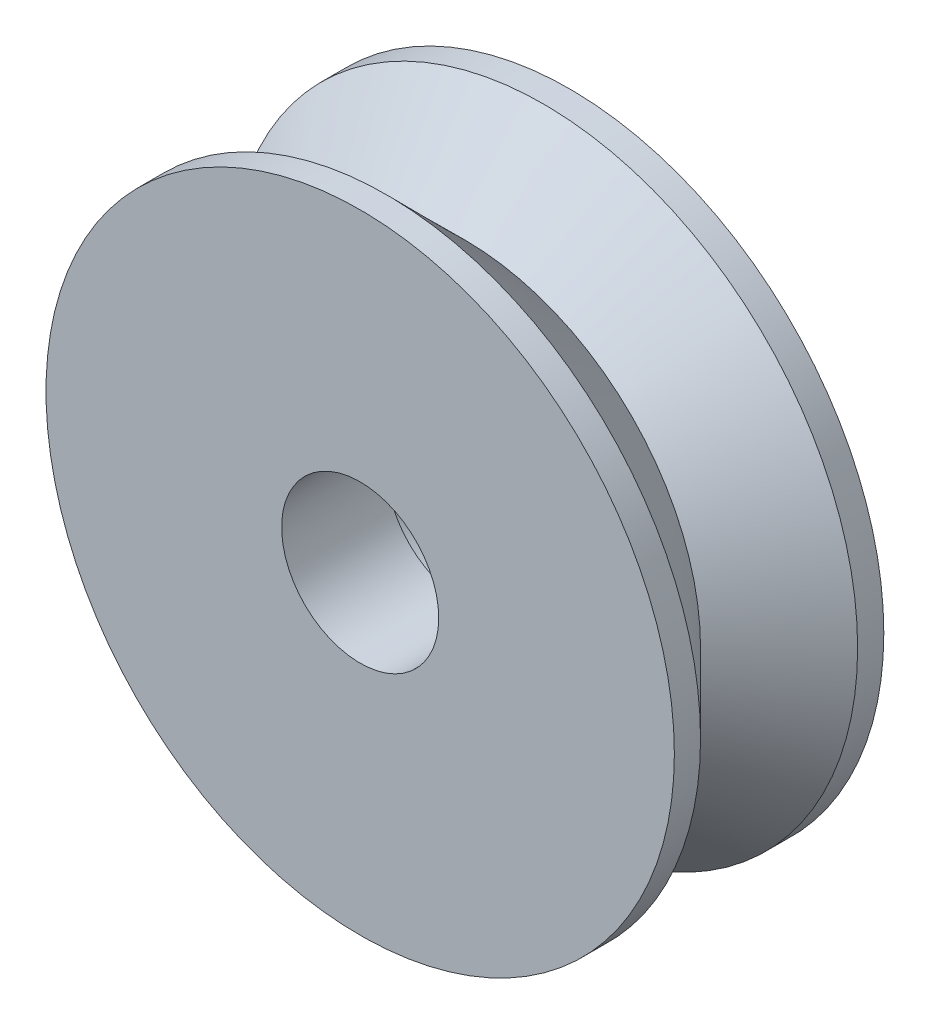
ISO-10303-21;
HEADER;
FILE_DESCRIPTION(('STEP AP214'),'2;1');
FILE_NAME('part.step','',(''),(''),'','','');
FILE_SCHEMA(('AUTOMOTIVE_DESIGN { 1 0 10303 214 1 1 1 1 }'));
ENDSEC;
DATA;
#1=APPLICATION_CONTEXT('core data for automotive mechanical design processes');
#2=APPLICATION_PROTOCOL_DEFINITION('international standard','automotive_design',2000,#1);
#3=PRODUCT_CONTEXT('',#1,'mechanical');
#4=PRODUCT('Part','Part','',(#3));
#5=PRODUCT_RELATED_PRODUCT_CATEGORY('part','',(#4));
#6=PRODUCT_DEFINITION_FORMATION('','',#4);
#7=PRODUCT_DEFINITION_CONTEXT('part definition',#1,'design');
#8=PRODUCT_DEFINITION('design','',#6,#7);
#9=PRODUCT_DEFINITION_SHAPE('','',#8);
#10=(LENGTH_UNIT() NAMED_UNIT(*) SI_UNIT(.MILLI.,.METRE.));
#11=(NAMED_UNIT(*) PLANE_ANGLE_UNIT() SI_UNIT($,.RADIAN.));
#12=(NAMED_UNIT(*) SI_UNIT($,.STERADIAN.) SOLID_ANGLE_UNIT());
#13=UNCERTAINTY_MEASURE_WITH_UNIT(LENGTH_MEASURE(1.E-05),#10,'distance_accuracy_value','');
#14=(GEOMETRIC_REPRESENTATION_CONTEXT(3) GLOBAL_UNCERTAINTY_ASSIGNED_CONTEXT((#13)) GLOBAL_UNIT_ASSIGNED_CONTEXT((#10,
#11,#12)) REPRESENTATION_CONTEXT('',''));
#15=CARTESIAN_POINT('',(0.,0.,0.));
#16=DIRECTION('',(0.,0.,1.));
#17=DIRECTION('',(1.,0.,0.));
#18=AXIS2_PLACEMENT_3D('',#15,#16,#17);
#19=CARTESIAN_POINT('',(0.,0.,0.));
#20=DIRECTION('',(0.,0.,1.));
#21=DIRECTION('',(1.,0.,0.));
#22=AXIS2_PLACEMENT_3D('',#19,#20,#21);
#23=PLANE('',#22);
#24=CARTESIAN_POINT('',(0.,0.,0.));
#25=DIRECTION('',(0.,0.,1.));
#26=DIRECTION('',(1.,0.,0.));
#27=AXIS2_PLACEMENT_3D('',#24,#25,#26);
#28=CIRCLE('',#27,5.99999999999908);
#29=CARTESIAN_POINT('',(5.99999999999908,0.,0.));
#30=VERTEX_POINT('',#29);
#31=EDGE_CURVE('E46',#30,#30,#28,.T.);
#32=ORIENTED_EDGE('',*,*,#31,.F.);
#33=EDGE_LOOP('',(#32));
#34=FACE_BOUND('',#33,.T.);
#35=CARTESIAN_POINT('',(0.,0.,0.));
#36=DIRECTION('',(0.,0.,1.));
#37=DIRECTION('',(1.,0.,0.));
#38=AXIS2_PLACEMENT_3D('',#35,#36,#37);
#39=CIRCLE('',#38,1.7);
#40=CARTESIAN_POINT('',(1.7,0.,0.));
#41=VERTEX_POINT('',#40);
#42=EDGE_CURVE('E51',#41,#41,#39,.T.);
#43=ORIENTED_EDGE('',*,*,#42,.T.);
#44=EDGE_LOOP('',(#43));
#45=FACE_BOUND('',#44,.T.);
#46=ADVANCED_FACE('F31',(#34,#45),#23,.F.);
#47=CARTESIAN_POINT('',(0.,0.,2.));
#48=DIRECTION('',(0.,0.,-1.));
#49=DIRECTION('',(-1.,0.,0.));
#50=AXIS2_PLACEMENT_3D('',#47,#48,#49);
#51=CYLINDRICAL_SURFACE('',#50,5.99999999999908);
#52=CARTESIAN_POINT('',(0.,0.,0.499999999999999));
#53=DIRECTION('',(0.,0.,1.));
#54=DIRECTION('',(1.,0.,0.));
#55=AXIS2_PLACEMENT_3D('',#52,#53,#54);
#56=CIRCLE('',#55,5.99999999999908);
#57=CARTESIAN_POINT('',(5.99999999999908,0.,0.499999999999999));
#58=VERTEX_POINT('',#57);
#59=EDGE_CURVE('E38',#58,#58,#56,.F.);
#60=ORIENTED_EDGE('',*,*,#59,.T.);
#61=EDGE_LOOP('',(#60));
#62=FACE_BOUND('',#61,.T.);
#63=ORIENTED_EDGE('',*,*,#31,.T.);
#64=EDGE_LOOP('',(#63));
#65=FACE_BOUND('',#64,.T.);
#66=ADVANCED_FACE('F86',(#62,#65),#51,.T.);
#67=CARTESIAN_POINT('',(0.,0.,2.));
#68=DIRECTION('',(0.,0.,-1.));
#69=DIRECTION('',(-1.,0.,0.));
#70=AXIS2_PLACEMENT_3D('',#67,#68,#69);
#71=CYLINDRICAL_SURFACE('',#70,1.7);
#72=CARTESIAN_POINT('',(0.,0.,2.));
#73=DIRECTION('',(0.,0.,1.));
#74=DIRECTION('',(1.,0.,0.));
#75=AXIS2_PLACEMENT_3D('',#72,#73,#74);
#76=CIRCLE('',#75,1.7);
#77=CARTESIAN_POINT('',(1.7,0.,2.));
#78=VERTEX_POINT('',#77);
#79=EDGE_CURVE('E54',#78,#78,#76,.T.);
#80=ORIENTED_EDGE('',*,*,#79,.T.);
#81=EDGE_LOOP('',(#80));
#82=FACE_BOUND('',#81,.T.);
#83=ORIENTED_EDGE('',*,*,#42,.F.);
#84=EDGE_LOOP('',(#83));
#85=FACE_BOUND('',#84,.T.);
#86=ADVANCED_FACE('F92',(#82,#85),#71,.F.);
#87=CARTESIAN_POINT('',(0.,0.,2.));
#88=DIRECTION('',(0.,0.,-1.));
#89=DIRECTION('',(-1.,0.,0.));
#90=AXIS2_PLACEMENT_3D('',#87,#88,#89);
#91=CONICAL_SURFACE('',#90,4.49999999999909,0.785398163397447);
#92=ORIENTED_EDGE('',*,*,#59,.F.);
#93=EDGE_LOOP('',(#92));
#94=FACE_BOUND('',#93,.T.);
#95=CARTESIAN_POINT('',(0.,0.,2.));
#96=DIRECTION('',(0.,0.,1.));
#97=DIRECTION('',(1.,0.,0.));
#98=AXIS2_PLACEMENT_3D('',#95,#96,#97);
#99=CIRCLE('',#98,4.49999999999909);
#100=CARTESIAN_POINT('',(4.49999999999909,0.,2.));
#101=VERTEX_POINT('',#100);
#102=EDGE_CURVE('E42',#101,#101,#99,.T.);
#103=ORIENTED_EDGE('',*,*,#102,.F.);
#104=EDGE_LOOP('',(#103));
#105=FACE_BOUND('',#104,.T.);
#106=ADVANCED_FACE('F81',(#94,#105),#91,.T.);
#107=CARTESIAN_POINT('',(0.,0.,2.));
#108=DIRECTION('',(0.,0.,1.));
#109=DIRECTION('',(1.,0.,0.));
#110=AXIS2_PLACEMENT_3D('',#107,#108,#109);
#111=PLANE('',#110);
#112=ORIENTED_EDGE('',*,*,#79,.F.);
#113=EDGE_LOOP('',(#112));
#114=FACE_BOUND('',#113,.T.);
#115=CARTESIAN_POINT('',(0.,0.,2.));
#116=DIRECTION('',(0.,0.,1.));
#117=DIRECTION('',(1.,0.,0.));
#118=AXIS2_PLACEMENT_3D('',#115,#116,#117);
#119=CIRCLE('',#118,1.5);
#120=CARTESIAN_POINT('',(1.5,0.,2.));
#121=VERTEX_POINT('',#120);
#122=EDGE_CURVE('E61',#121,#121,#119,.T.);
#123=ORIENTED_EDGE('',*,*,#122,.T.);
#124=EDGE_LOOP('',(#123));
#125=FACE_BOUND('',#124,.T.);
#126=ADVANCED_FACE('F73',(#114,#125),#111,.F.);
#127=CARTESIAN_POINT('',(0.,0.,4.));
#128=DIRECTION('',(0.,0.,1.));
#129=DIRECTION('',(1.,0.,0.));
#130=AXIS2_PLACEMENT_3D('',#127,#128,#129);
#131=PLANE('',#130);
#132=CARTESIAN_POINT('',(0.,0.,4.));
#133=DIRECTION('',(0.,0.,1.));
#134=DIRECTION('',(1.,0.,0.));
#135=AXIS2_PLACEMENT_3D('',#132,#133,#134);
#136=CIRCLE('',#135,5.99999999999908);
#137=CARTESIAN_POINT('',(5.99999999999908,0.,4.));
#138=VERTEX_POINT('',#137);
#139=EDGE_CURVE('E57',#138,#138,#136,.T.);
#140=ORIENTED_EDGE('',*,*,#139,.T.);
#141=EDGE_LOOP('',(#140));
#142=FACE_BOUND('',#141,.T.);
#143=CARTESIAN_POINT('',(0.,0.,4.));
#144=DIRECTION('',(0.,0.,1.));
#145=DIRECTION('',(1.,0.,0.));
#146=AXIS2_PLACEMENT_3D('',#143,#144,#145);
#147=CIRCLE('',#146,1.5);
#148=CARTESIAN_POINT('',(1.5,0.,4.));
#149=VERTEX_POINT('',#148);
#150=EDGE_CURVE('E60',#149,#149,#147,.T.);
#151=ORIENTED_EDGE('',*,*,#150,.F.);
#152=EDGE_LOOP('',(#151));
#153=FACE_BOUND('',#152,.T.);
#154=ADVANCED_FACE('F70',(#142,#153),#131,.T.);
#155=CARTESIAN_POINT('',(0.,0.,4.));
#156=DIRECTION('',(0.,0.,-1.));
#157=DIRECTION('',(-1.,0.,0.));
#158=AXIS2_PLACEMENT_3D('',#155,#156,#157);
#159=CYLINDRICAL_SURFACE('',#158,5.99999999999908);
#160=CARTESIAN_POINT('',(0.,0.,3.5));
#161=DIRECTION('',(0.,0.,1.));
#162=DIRECTION('',(1.,0.,0.));
#163=AXIS2_PLACEMENT_3D('',#160,#161,#162);
#164=CIRCLE('',#163,5.99999999999908);
#165=CARTESIAN_POINT('',(5.99999999999908,0.,3.5));
#166=VERTEX_POINT('',#165);
#167=EDGE_CURVE('E10',#166,#166,#164,.T.);
#168=ORIENTED_EDGE('',*,*,#167,.T.);
#169=EDGE_LOOP('',(#168));
#170=FACE_BOUND('',#169,.T.);
#171=ORIENTED_EDGE('',*,*,#139,.F.);
#172=EDGE_LOOP('',(#171));
#173=FACE_BOUND('',#172,.T.);
#174=ADVANCED_FACE('F72',(#170,#173),#159,.T.);
#175=CARTESIAN_POINT('',(0.,0.,4.));
#176=DIRECTION('',(0.,0.,-1.));
#177=DIRECTION('',(-1.,0.,0.));
#178=AXIS2_PLACEMENT_3D('',#175,#176,#177);
#179=CYLINDRICAL_SURFACE('',#178,1.5);
#180=ORIENTED_EDGE('',*,*,#150,.T.);
#181=EDGE_LOOP('',(#180));
#182=FACE_BOUND('',#181,.T.);
#183=ORIENTED_EDGE('',*,*,#122,.F.);
#184=EDGE_LOOP('',(#183));
#185=FACE_BOUND('',#184,.T.);
#186=ADVANCED_FACE('F67',(#182,#185),#179,.F.);
#187=CARTESIAN_POINT('',(0.,0.,3.5));
#188=DIRECTION('',(0.,0.,1.));
#189=DIRECTION('',(1.,0.,0.));
#190=AXIS2_PLACEMENT_3D('',#187,#188,#189);
#191=CONICAL_SURFACE('',#190,5.99999999999908,0.785398163397451);
#192=ORIENTED_EDGE('',*,*,#102,.T.);
#193=EDGE_LOOP('',(#192));
#194=FACE_BOUND('',#193,.T.);
#195=ORIENTED_EDGE('',*,*,#167,.F.);
#196=EDGE_LOOP('',(#195));
#197=FACE_BOUND('',#196,.T.);
#198=ADVANCED_FACE('F33',(#194,#197),#191,.T.);
#199=CLOSED_SHELL('',(#46,#66,#86,#106,#126,#154,#174,#186,#198));
#200=MANIFOLD_SOLID_BREP('B2',#199);
#201=ADVANCED_BREP_SHAPE_REPRESENTATION('',(#18,#200),#14);
#202=SHAPE_DEFINITION_REPRESENTATION(#9,#201);
ENDSEC;
END-ISO-10303-21;
